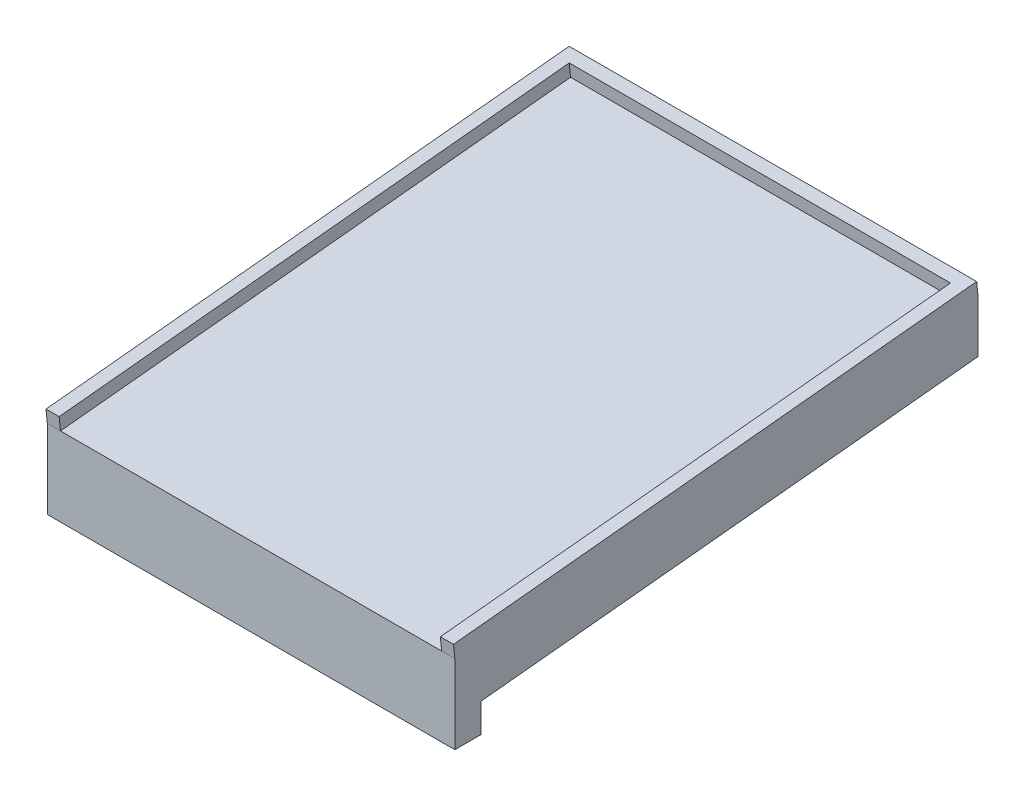
ISO-10303-21;
HEADER;
FILE_DESCRIPTION(('STEP AP214'),'2;1');
FILE_NAME('part.step','',(''),(''),'','','');
FILE_SCHEMA(('AUTOMOTIVE_DESIGN { 1 0 10303 214 1 1 1 1 }'));
ENDSEC;
DATA;
#1=APPLICATION_CONTEXT('core data for automotive mechanical design processes');
#2=APPLICATION_PROTOCOL_DEFINITION('international standard','automotive_design',2000,#1);
#3=PRODUCT_CONTEXT('',#1,'mechanical');
#4=PRODUCT('Part','Part','',(#3));
#5=PRODUCT_RELATED_PRODUCT_CATEGORY('part','',(#4));
#6=PRODUCT_DEFINITION_FORMATION('','',#4);
#7=PRODUCT_DEFINITION_CONTEXT('part definition',#1,'design');
#8=PRODUCT_DEFINITION('design','',#6,#7);
#9=PRODUCT_DEFINITION_SHAPE('','',#8);
#10=(LENGTH_UNIT() NAMED_UNIT(*) SI_UNIT(.MILLI.,.METRE.));
#11=(NAMED_UNIT(*) PLANE_ANGLE_UNIT() SI_UNIT($,.RADIAN.));
#12=(NAMED_UNIT(*) SI_UNIT($,.STERADIAN.) SOLID_ANGLE_UNIT());
#13=UNCERTAINTY_MEASURE_WITH_UNIT(LENGTH_MEASURE(1.E-05),#10,'distance_accuracy_value','');
#14=(GEOMETRIC_REPRESENTATION_CONTEXT(3) GLOBAL_UNCERTAINTY_ASSIGNED_CONTEXT((#13)) GLOBAL_UNIT_ASSIGNED_CONTEXT((#10,
#11,#12)) REPRESENTATION_CONTEXT('',''));
#15=CARTESIAN_POINT('',(0.,0.,0.));
#16=DIRECTION('',(0.,0.,1.));
#17=DIRECTION('',(1.,0.,0.));
#18=AXIS2_PLACEMENT_3D('',#15,#16,#17);
#19=CARTESIAN_POINT('',(155.,0.,0.));
#20=DIRECTION('',(0.,0.99498743710662,0.1));
#21=DIRECTION('',(0.,-0.1,0.99498743710662));
#22=AXIS2_PLACEMENT_3D('',#19,#20,#21);
#23=PLANE('',#22);
#24=DIRECTION('',(1.,0.,0.));
#25=VECTOR('',#24,1.);
#26=CARTESIAN_POINT('',(155.,1.00503781525921,-10.));
#27=LINE('',#26,#25);
#28=CARTESIAN_POINT('',(0.,1.00503781525921,-10.));
#29=VERTEX_POINT('',#28);
#30=CARTESIAN_POINT('',(155.,1.00503781525921,-10.));
#31=VERTEX_POINT('',#30);
#32=EDGE_CURVE('E68',#29,#31,#27,.T.);
#33=ORIENTED_EDGE('',*,*,#32,.F.);
#34=DIRECTION('',(0.,0.1,-0.99498743710662));
#35=VECTOR('',#34,1.);
#36=CARTESIAN_POINT('',(0.,0.,0.));
#37=LINE('',#36,#35);
#38=CARTESIAN_POINT('',(0.,20.,-198.997487421324));
#39=VERTEX_POINT('',#38);
#40=EDGE_CURVE('E240',#29,#39,#37,.T.);
#41=ORIENTED_EDGE('',*,*,#40,.T.);
#42=DIRECTION('',(-1.,0.,0.));
#43=VECTOR('',#42,1.);
#44=CARTESIAN_POINT('',(155.,20.,-198.997487421324));
#45=LINE('',#44,#43);
#46=CARTESIAN_POINT('',(155.,20.,-198.997487421324));
#47=VERTEX_POINT('',#46);
#48=EDGE_CURVE('E11',#47,#39,#45,.T.);
#49=ORIENTED_EDGE('',*,*,#48,.F.);
#50=DIRECTION('',(0.,0.1,-0.99498743710662));
#51=VECTOR('',#50,1.);
#52=CARTESIAN_POINT('',(155.,0.,0.));
#53=LINE('',#52,#51);
#54=EDGE_CURVE('E64',#31,#47,#53,.T.);
#55=ORIENTED_EDGE('',*,*,#54,.F.);
#56=EDGE_LOOP('',(#33,#41,#49,#55));
#57=FACE_BOUND('',#56,.T.);
#58=ADVANCED_FACE('F49',(#57),#23,.F.);
#59=CARTESIAN_POINT('',(155.,2.76164490472136E-13,-198.997487421324));
#60=DIRECTION('',(0.,0.,1.));
#61=DIRECTION('',(0.,-1.,0.));
#62=AXIS2_PLACEMENT_3D('',#59,#60,#61);
#63=PLANE('',#62);
#64=DIRECTION('',(0.,1.,0.));
#65=VECTOR('',#64,1.);
#66=CARTESIAN_POINT('',(0.,2.76164490472136E-13,-198.997487421324));
#67=LINE('',#66,#65);
#68=CARTESIAN_POINT('',(0.,40.,-198.997487421324));
#69=VERTEX_POINT('',#68);
#70=EDGE_CURVE('E255',#39,#69,#67,.T.);
#71=ORIENTED_EDGE('',*,*,#70,.T.);
#72=DIRECTION('',(-1.,0.,0.));
#73=VECTOR('',#72,1.);
#74=CARTESIAN_POINT('',(155.,40.,-198.997487421324));
#75=LINE('',#74,#73);
#76=CARTESIAN_POINT('',(155.,40.,-198.997487421324));
#77=VERTEX_POINT('',#76);
#78=EDGE_CURVE('E57',#77,#69,#75,.T.);
#79=ORIENTED_EDGE('',*,*,#78,.F.);
#80=DIRECTION('',(0.,1.,0.));
#81=VECTOR('',#80,1.);
#82=CARTESIAN_POINT('',(155.,2.76164490472136E-13,-198.997487421324));
#83=LINE('',#82,#81);
#84=EDGE_CURVE('E243',#47,#77,#83,.T.);
#85=ORIENTED_EDGE('',*,*,#84,.F.);
#86=ORIENTED_EDGE('',*,*,#48,.T.);
#87=EDGE_LOOP('',(#71,#79,#85,#86));
#88=FACE_BOUND('',#87,.T.);
#89=ADVANCED_FACE('F277',(#88),#63,.F.);
#90=CARTESIAN_POINT('',(155.,19.8,1.98997487421324));
#91=DIRECTION('',(0.,0.99498743710662,0.1));
#92=DIRECTION('',(0.,-0.1,0.99498743710662));
#93=AXIS2_PLACEMENT_3D('',#90,#91,#92);
#94=PLANE('',#93);
#95=DIRECTION('',(0.,-0.1,0.99498743710662));
#96=VECTOR('',#95,1.);
#97=CARTESIAN_POINT('',(5.00000000000003,19.8,1.98997487421324));
#98=LINE('',#97,#96);
#99=CARTESIAN_POINT('',(5.,39.5,-194.022550235791));
#100=VERTEX_POINT('',#99);
#101=CARTESIAN_POINT('',(5.00000000000003,20.,0.));
#102=VERTEX_POINT('',#101);
#103=EDGE_CURVE('E142',#100,#102,#98,.T.);
#104=ORIENTED_EDGE('',*,*,#103,.T.);
#105=DIRECTION('',(-1.,0.,0.));
#106=VECTOR('',#105,1.);
#107=CARTESIAN_POINT('',(155.,20.,0.));
#108=LINE('',#107,#106);
#109=CARTESIAN_POINT('',(150.,20.,0.));
#110=VERTEX_POINT('',#109);
#111=EDGE_CURVE('E252',#110,#102,#108,.T.);
#112=ORIENTED_EDGE('',*,*,#111,.F.);
#113=DIRECTION('',(0.,0.1,-0.99498743710662));
#114=VECTOR('',#113,1.);
#115=CARTESIAN_POINT('',(150.,19.8,1.98997487421324));
#116=LINE('',#115,#114);
#117=CARTESIAN_POINT('',(150.,39.5,-194.022550235791));
#118=VERTEX_POINT('',#117);
#119=EDGE_CURVE('E168',#110,#118,#116,.T.);
#120=ORIENTED_EDGE('',*,*,#119,.T.);
#121=DIRECTION('',(1.,0.,0.));
#122=VECTOR('',#121,1.);
#123=CARTESIAN_POINT('',(0.,39.5,-194.022550235791));
#124=LINE('',#123,#122);
#125=EDGE_CURVE('E190',#100,#118,#124,.T.);
#126=ORIENTED_EDGE('',*,*,#125,.F.);
#127=EDGE_LOOP('',(#104,#112,#120,#126));
#128=FACE_BOUND('',#127,.T.);
#129=ADVANCED_FACE('F292',(#128),#94,.T.);
#130=CARTESIAN_POINT('',(155.,0.,0.));
#131=DIRECTION('',(0.,0.,1.));
#132=DIRECTION('',(0.,-1.,0.));
#133=AXIS2_PLACEMENT_3D('',#130,#131,#132);
#134=PLANE('',#133);
#135=CARTESIAN_POINT('',(155.,20.,0.));
#136=VERTEX_POINT('',#135);
#137=EDGE_CURVE('E262',#136,#110,#108,.T.);
#138=ORIENTED_EDGE('',*,*,#137,.T.);
#139=ORIENTED_EDGE('',*,*,#111,.T.);
#140=DIRECTION('',(1.,0.,0.));
#141=VECTOR('',#140,1.);
#142=CARTESIAN_POINT('',(0.,20.,0.));
#143=LINE('',#142,#141);
#144=CARTESIAN_POINT('',(0.,20.,0.));
#145=VERTEX_POINT('',#144);
#146=EDGE_CURVE('E164',#145,#102,#143,.T.);
#147=ORIENTED_EDGE('',*,*,#146,.F.);
#148=DIRECTION('',(0.,1.,0.));
#149=VECTOR('',#148,1.);
#150=CARTESIAN_POINT('',(0.,0.,0.));
#151=LINE('',#150,#149);
#152=CARTESIAN_POINT('',(0.,-10.,0.));
#153=VERTEX_POINT('',#152);
#154=EDGE_CURVE('E244',#153,#145,#151,.T.);
#155=ORIENTED_EDGE('',*,*,#154,.F.);
#156=DIRECTION('',(1.,0.,0.));
#157=VECTOR('',#156,1.);
#158=CARTESIAN_POINT('',(0.,-10.,0.));
#159=LINE('',#158,#157);
#160=CARTESIAN_POINT('',(155.,-10.,0.));
#161=VERTEX_POINT('',#160);
#162=EDGE_CURVE('E147',#153,#161,#159,.T.);
#163=ORIENTED_EDGE('',*,*,#162,.T.);
#164=DIRECTION('',(0.,1.,0.));
#165=VECTOR('',#164,1.);
#166=CARTESIAN_POINT('',(155.,0.,0.));
#167=LINE('',#166,#165);
#168=EDGE_CURVE('E248',#161,#136,#167,.T.);
#169=ORIENTED_EDGE('',*,*,#168,.T.);
#170=EDGE_LOOP('',(#138,#139,#147,#155,#163,#169));
#171=FACE_BOUND('',#170,.T.);
#172=ADVANCED_FACE('F297',(#171),#134,.T.);
#173=CARTESIAN_POINT('',(155.,0.,0.));
#174=DIRECTION('',(1.,0.,0.));
#175=DIRECTION('',(0.,0.,-1.));
#176=AXIS2_PLACEMENT_3D('',#173,#174,#175);
#177=PLANE('',#176);
#178=ORIENTED_EDGE('',*,*,#84,.T.);
#179=DIRECTION('',(0.,-0.99498743710662,-0.1));
#180=VECTOR('',#179,1.);
#181=CARTESIAN_POINT('',(155.,44.9749371855331,-198.497487421324));
#182=LINE('',#181,#180);
#183=CARTESIAN_POINT('',(155.,44.9749371855331,-198.497487421324));
#184=VERTEX_POINT('',#183);
#185=EDGE_CURVE('E204',#184,#77,#182,.T.);
#186=ORIENTED_EDGE('',*,*,#185,.F.);
#187=DIRECTION('',(0.,0.1,-0.99498743710662));
#188=VECTOR('',#187,1.);
#189=CARTESIAN_POINT('',(155.,24.7749371855331,2.48997487421324));
#190=LINE('',#189,#188);
#191=CARTESIAN_POINT('',(155.,24.9749371855331,0.499999999999999));
#192=VERTEX_POINT('',#191);
#193=EDGE_CURVE('E176',#192,#184,#190,.T.);
#194=ORIENTED_EDGE('',*,*,#193,.F.);
#195=DIRECTION('',(0.,-0.99498743710662,-0.1));
#196=VECTOR('',#195,1.);
#197=CARTESIAN_POINT('',(155.,24.9749371855331,0.499999999999999));
#198=LINE('',#197,#196);
#199=EDGE_CURVE('E207',#192,#136,#198,.T.);
#200=ORIENTED_EDGE('',*,*,#199,.T.);
#201=ORIENTED_EDGE('',*,*,#168,.F.);
#202=DIRECTION('',(0.,0.,1.));
#203=VECTOR('',#202,1.);
#204=CARTESIAN_POINT('',(155.,-10.,-10.));
#205=LINE('',#204,#203);
#206=CARTESIAN_POINT('',(155.,-10.,-10.));
#207=VERTEX_POINT('',#206);
#208=EDGE_CURVE('E231',#207,#161,#205,.T.);
#209=ORIENTED_EDGE('',*,*,#208,.F.);
#210=DIRECTION('',(0.,1.,0.));
#211=VECTOR('',#210,1.);
#212=CARTESIAN_POINT('',(155.,9.99999999999998,-10.));
#213=LINE('',#212,#211);
#214=EDGE_CURVE('E223',#207,#31,#213,.T.);
#215=ORIENTED_EDGE('',*,*,#214,.T.);
#216=ORIENTED_EDGE('',*,*,#54,.T.);
#217=EDGE_LOOP('',(#178,#186,#194,#200,#201,#209,#215,#216));
#218=FACE_BOUND('',#217,.T.);
#219=ADVANCED_FACE('F286',(#218),#177,.T.);
#220=CARTESIAN_POINT('',(0.,0.,0.));
#221=DIRECTION('',(1.,0.,0.));
#222=DIRECTION('',(0.,0.,-1.));
#223=AXIS2_PLACEMENT_3D('',#220,#221,#222);
#224=PLANE('',#223);
#225=ORIENTED_EDGE('',*,*,#154,.T.);
#226=DIRECTION('',(0.,-0.99498743710662,-0.1));
#227=VECTOR('',#226,1.);
#228=CARTESIAN_POINT('',(0.,24.9749371855331,0.499999999999999));
#229=LINE('',#228,#227);
#230=CARTESIAN_POINT('',(0.,24.9749371855331,0.499999999999999));
#231=VERTEX_POINT('',#230);
#232=EDGE_CURVE('E198',#231,#145,#229,.T.);
#233=ORIENTED_EDGE('',*,*,#232,.F.);
#234=DIRECTION('',(0.,-0.1,0.99498743710662));
#235=VECTOR('',#234,1.);
#236=CARTESIAN_POINT('',(0.,24.7749371855331,2.48997487421324));
#237=LINE('',#236,#235);
#238=CARTESIAN_POINT('',(0.,44.9749371855331,-198.497487421324));
#239=VERTEX_POINT('',#238);
#240=EDGE_CURVE('E182',#239,#231,#237,.T.);
#241=ORIENTED_EDGE('',*,*,#240,.F.);
#242=DIRECTION('',(0.,-0.99498743710662,-0.1));
#243=VECTOR('',#242,1.);
#244=CARTESIAN_POINT('',(0.,44.9749371855331,-198.497487421324));
#245=LINE('',#244,#243);
#246=EDGE_CURVE('E201',#239,#69,#245,.T.);
#247=ORIENTED_EDGE('',*,*,#246,.T.);
#248=ORIENTED_EDGE('',*,*,#70,.F.);
#249=ORIENTED_EDGE('',*,*,#40,.F.);
#250=DIRECTION('',(0.,-1.,0.));
#251=VECTOR('',#250,1.);
#252=CARTESIAN_POINT('',(0.,10.,-10.));
#253=LINE('',#252,#251);
#254=CARTESIAN_POINT('',(0.,-10.,-10.));
#255=VERTEX_POINT('',#254);
#256=EDGE_CURVE('E216',#29,#255,#253,.T.);
#257=ORIENTED_EDGE('',*,*,#256,.T.);
#258=DIRECTION('',(0.,0.,1.));
#259=VECTOR('',#258,1.);
#260=CARTESIAN_POINT('',(0.,-10.,-10.));
#261=LINE('',#260,#259);
#262=EDGE_CURVE('E227',#255,#153,#261,.T.);
#263=ORIENTED_EDGE('',*,*,#262,.T.);
#264=EDGE_LOOP('',(#225,#233,#241,#247,#248,#249,#257,#263));
#265=FACE_BOUND('',#264,.T.);
#266=ADVANCED_FACE('F279',(#265),#224,.F.);
#267=CARTESIAN_POINT('',(0.,0.,-10.));
#268=DIRECTION('',(0.,0.,1.));
#269=DIRECTION('',(1.,0.,0.));
#270=AXIS2_PLACEMENT_3D('',#267,#268,#269);
#271=PLANE('',#270);
#272=ORIENTED_EDGE('',*,*,#256,.F.);
#273=ORIENTED_EDGE('',*,*,#32,.T.);
#274=ORIENTED_EDGE('',*,*,#214,.F.);
#275=DIRECTION('',(1.,0.,0.));
#276=VECTOR('',#275,1.);
#277=CARTESIAN_POINT('',(0.,-10.,-10.));
#278=LINE('',#277,#276);
#279=EDGE_CURVE('E219',#255,#207,#278,.T.);
#280=ORIENTED_EDGE('',*,*,#279,.F.);
#281=EDGE_LOOP('',(#272,#273,#274,#280));
#282=FACE_BOUND('',#281,.T.);
#283=ADVANCED_FACE('F306',(#282),#271,.F.);
#284=CARTESIAN_POINT('',(0.,-10.,-10.));
#285=DIRECTION('',(0.,-1.,0.));
#286=DIRECTION('',(1.,0.,0.));
#287=AXIS2_PLACEMENT_3D('',#284,#285,#286);
#288=PLANE('',#287);
#289=ORIENTED_EDGE('',*,*,#162,.F.);
#290=ORIENTED_EDGE('',*,*,#262,.F.);
#291=ORIENTED_EDGE('',*,*,#279,.T.);
#292=ORIENTED_EDGE('',*,*,#208,.T.);
#293=EDGE_LOOP('',(#289,#290,#291,#292));
#294=FACE_BOUND('',#293,.T.);
#295=ADVANCED_FACE('F309',(#294),#288,.T.);
#296=CARTESIAN_POINT('',(5.00000000000003,24.7749371855331,2.48997487421324));
#297=DIRECTION('',(1.,0.,0.));
#298=DIRECTION('',(0.,0.,-1.));
#299=AXIS2_PLACEMENT_3D('',#296,#297,#298);
#300=PLANE('',#299);
#301=ORIENTED_EDGE('',*,*,#103,.F.);
#302=DIRECTION('',(0.,-0.99498743710662,-0.1));
#303=VECTOR('',#302,1.);
#304=CARTESIAN_POINT('',(5.,44.4749371855331,-193.522550235791));
#305=LINE('',#304,#303);
#306=CARTESIAN_POINT('',(5.,44.4749371855331,-193.522550235791));
#307=VERTEX_POINT('',#306);
#308=EDGE_CURVE('E136',#307,#100,#305,.T.);
#309=ORIENTED_EDGE('',*,*,#308,.F.);
#310=DIRECTION('',(0.,-0.1,0.99498743710662));
#311=VECTOR('',#310,1.);
#312=CARTESIAN_POINT('',(5.00000000000003,24.7749371855331,2.48997487421324));
#313=LINE('',#312,#311);
#314=CARTESIAN_POINT('',(5.00000000000003,24.9749371855331,0.499999999999999));
#315=VERTEX_POINT('',#314);
#316=EDGE_CURVE('E140',#307,#315,#313,.T.);
#317=ORIENTED_EDGE('',*,*,#316,.T.);
#318=DIRECTION('',(0.,-0.99498743710662,-0.1));
#319=VECTOR('',#318,1.);
#320=CARTESIAN_POINT('',(5.00000000000003,24.9749371855331,0.499999999999999));
#321=LINE('',#320,#319);
#322=EDGE_CURVE('E187',#315,#102,#321,.T.);
#323=ORIENTED_EDGE('',*,*,#322,.T.);
#324=EDGE_LOOP('',(#301,#309,#317,#323));
#325=FACE_BOUND('',#324,.T.);
#326=ADVANCED_FACE('F138',(#325),#300,.T.);
#327=CARTESIAN_POINT('',(0.,44.4749371855331,-193.522550235791));
#328=DIRECTION('',(0.,0.1,-0.99498743710662));
#329=DIRECTION('',(0.,0.99498743710662,0.1));
#330=AXIS2_PLACEMENT_3D('',#327,#328,#329);
#331=PLANE('',#330);
#332=ORIENTED_EDGE('',*,*,#125,.T.);
#333=DIRECTION('',(0.,-0.99498743710662,-0.1));
#334=VECTOR('',#333,1.);
#335=CARTESIAN_POINT('',(150.,44.4749371855331,-193.522550235791));
#336=LINE('',#335,#334);
#337=CARTESIAN_POINT('',(150.,44.4749371855331,-193.522550235791));
#338=VERTEX_POINT('',#337);
#339=EDGE_CURVE('E148',#338,#118,#336,.T.);
#340=ORIENTED_EDGE('',*,*,#339,.F.);
#341=DIRECTION('',(1.,0.,0.));
#342=VECTOR('',#341,1.);
#343=CARTESIAN_POINT('',(0.,44.4749371855331,-193.522550235791));
#344=LINE('',#343,#342);
#345=EDGE_CURVE('E151',#307,#338,#344,.T.);
#346=ORIENTED_EDGE('',*,*,#345,.F.);
#347=ORIENTED_EDGE('',*,*,#308,.T.);
#348=EDGE_LOOP('',(#332,#340,#346,#347));
#349=FACE_BOUND('',#348,.T.);
#350=ADVANCED_FACE('F152',(#349),#331,.F.);
#351=CARTESIAN_POINT('',(150.,24.7749371855331,2.48997487421324));
#352=DIRECTION('',(-1.,0.,0.));
#353=DIRECTION('',(0.,0.,1.));
#354=AXIS2_PLACEMENT_3D('',#351,#352,#353);
#355=PLANE('',#354);
#356=ORIENTED_EDGE('',*,*,#119,.F.);
#357=DIRECTION('',(0.,-0.99498743710662,-0.1));
#358=VECTOR('',#357,1.);
#359=CARTESIAN_POINT('',(150.,24.9749371855331,0.499999999999999));
#360=LINE('',#359,#358);
#361=CARTESIAN_POINT('',(150.,24.9749371855331,0.499999999999999));
#362=VERTEX_POINT('',#361);
#363=EDGE_CURVE('E211',#362,#110,#360,.T.);
#364=ORIENTED_EDGE('',*,*,#363,.F.);
#365=DIRECTION('',(0.,0.1,-0.99498743710662));
#366=VECTOR('',#365,1.);
#367=CARTESIAN_POINT('',(150.,24.7749371855331,2.48997487421324));
#368=LINE('',#367,#366);
#369=EDGE_CURVE('E157',#362,#338,#368,.T.);
#370=ORIENTED_EDGE('',*,*,#369,.T.);
#371=ORIENTED_EDGE('',*,*,#339,.T.);
#372=EDGE_LOOP('',(#356,#364,#370,#371));
#373=FACE_BOUND('',#372,.T.);
#374=ADVANCED_FACE('F318',(#373),#355,.T.);
#375=CARTESIAN_POINT('',(0.,24.9749371855331,0.499999999999999));
#376=DIRECTION('',(0.,0.1,-0.99498743710662));
#377=DIRECTION('',(0.,0.99498743710662,0.1));
#378=AXIS2_PLACEMENT_3D('',#375,#376,#377);
#379=PLANE('',#378);
#380=ORIENTED_EDGE('',*,*,#137,.F.);
#381=ORIENTED_EDGE('',*,*,#199,.F.);
#382=DIRECTION('',(1.,0.,0.));
#383=VECTOR('',#382,1.);
#384=CARTESIAN_POINT('',(0.,24.9749371855331,0.499999999999999));
#385=LINE('',#384,#383);
#386=EDGE_CURVE('E173',#362,#192,#385,.T.);
#387=ORIENTED_EDGE('',*,*,#386,.F.);
#388=ORIENTED_EDGE('',*,*,#363,.T.);
#389=EDGE_LOOP('',(#380,#381,#387,#388));
#390=FACE_BOUND('',#389,.T.);
#391=ADVANCED_FACE('F321',(#390),#379,.F.);
#392=CARTESIAN_POINT('',(0.,44.9749371855331,-198.497487421324));
#393=DIRECTION('',(0.,-0.1,0.99498743710662));
#394=DIRECTION('',(0.,-0.99498743710662,-0.1));
#395=AXIS2_PLACEMENT_3D('',#392,#393,#394);
#396=PLANE('',#395);
#397=ORIENTED_EDGE('',*,*,#78,.T.);
#398=ORIENTED_EDGE('',*,*,#246,.F.);
#399=DIRECTION('',(-1.,0.,0.));
#400=VECTOR('',#399,1.);
#401=CARTESIAN_POINT('',(0.,44.9749371855331,-198.497487421324));
#402=LINE('',#401,#400);
#403=EDGE_CURVE('E179',#184,#239,#402,.T.);
#404=ORIENTED_EDGE('',*,*,#403,.F.);
#405=ORIENTED_EDGE('',*,*,#185,.T.);
#406=EDGE_LOOP('',(#397,#398,#404,#405));
#407=FACE_BOUND('',#406,.T.);
#408=ADVANCED_FACE('F270',(#407),#396,.F.);
#409=CARTESIAN_POINT('',(0.,24.9749371855331,0.499999999999999));
#410=DIRECTION('',(0.,0.1,-0.99498743710662));
#411=DIRECTION('',(0.,0.99498743710662,0.1));
#412=AXIS2_PLACEMENT_3D('',#409,#410,#411);
#413=PLANE('',#412);
#414=ORIENTED_EDGE('',*,*,#146,.T.);
#415=ORIENTED_EDGE('',*,*,#322,.F.);
#416=DIRECTION('',(1.,0.,0.));
#417=VECTOR('',#416,1.);
#418=CARTESIAN_POINT('',(0.,24.9749371855331,0.499999999999999));
#419=LINE('',#418,#417);
#420=EDGE_CURVE('E161',#231,#315,#419,.T.);
#421=ORIENTED_EDGE('',*,*,#420,.F.);
#422=ORIENTED_EDGE('',*,*,#232,.T.);
#423=EDGE_LOOP('',(#414,#415,#421,#422));
#424=FACE_BOUND('',#423,.T.);
#425=ADVANCED_FACE('F328',(#424),#413,.F.);
#426=CARTESIAN_POINT('',(0.,24.7749371855331,2.48997487421324));
#427=DIRECTION('',(0.,0.99498743710662,0.1));
#428=DIRECTION('',(0.,-0.1,0.99498743710662));
#429=AXIS2_PLACEMENT_3D('',#426,#427,#428);
#430=PLANE('',#429);
#431=ORIENTED_EDGE('',*,*,#316,.F.);
#432=ORIENTED_EDGE('',*,*,#345,.T.);
#433=ORIENTED_EDGE('',*,*,#369,.F.);
#434=ORIENTED_EDGE('',*,*,#386,.T.);
#435=ORIENTED_EDGE('',*,*,#193,.T.);
#436=ORIENTED_EDGE('',*,*,#403,.T.);
#437=ORIENTED_EDGE('',*,*,#240,.T.);
#438=ORIENTED_EDGE('',*,*,#420,.T.);
#439=EDGE_LOOP('',(#431,#432,#433,#434,#435,#436,#437,#438));
#440=FACE_BOUND('',#439,.T.);
#441=ADVANCED_FACE('F159',(#440),#430,.T.);
#442=CLOSED_SHELL('',(#58,#89,#129,#172,#219,#266,#283,#295,#326,#350,#374,#391,#408,#425,#441));
#443=MANIFOLD_SOLID_BREP('B2',#442);
#444=ADVANCED_BREP_SHAPE_REPRESENTATION('',(#18,#443),#14);
#445=SHAPE_DEFINITION_REPRESENTATION(#9,#444);
ENDSEC;
END-ISO-10303-21;
